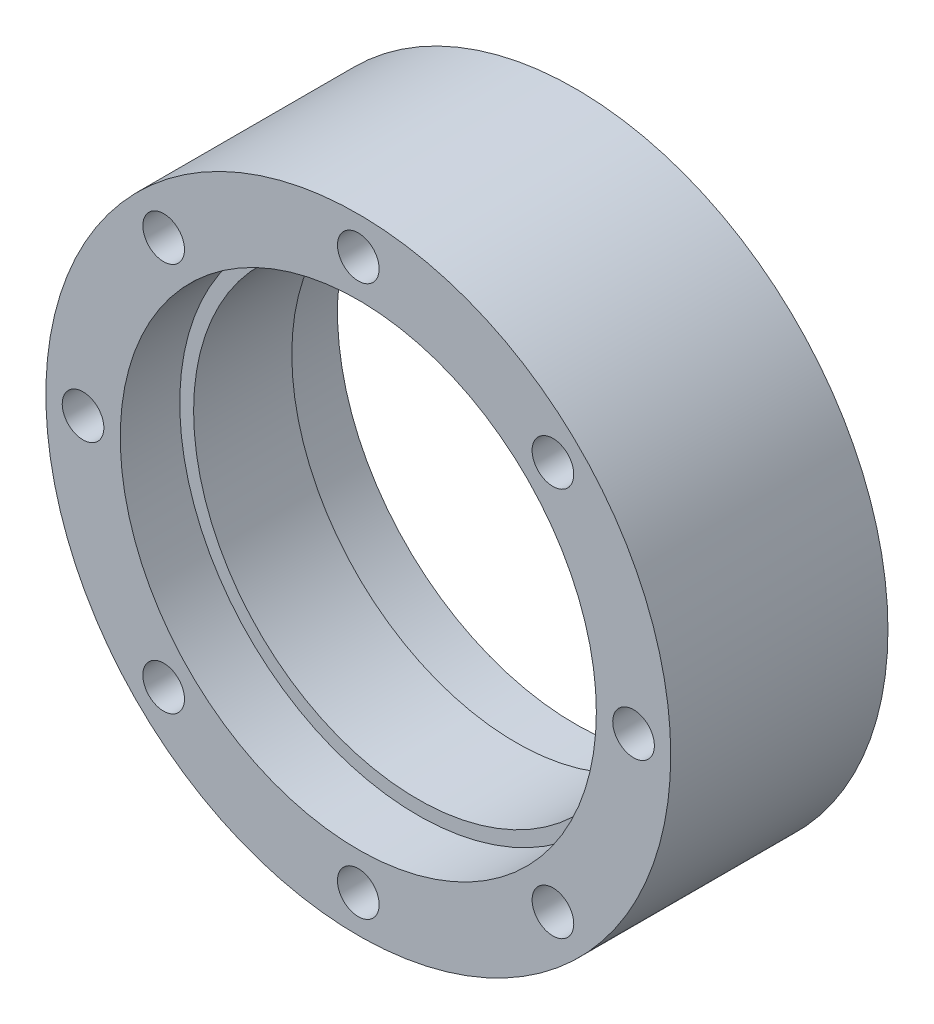
ISO-10303-21;
HEADER;
FILE_DESCRIPTION(('STEP AP214'),'2;1');
FILE_NAME('part.step','',(''),(''),'','','');
FILE_SCHEMA(('AUTOMOTIVE_DESIGN { 1 0 10303 214 1 1 1 1 }'));
ENDSEC;
DATA;
#1=APPLICATION_CONTEXT('core data for automotive mechanical design processes');
#2=APPLICATION_PROTOCOL_DEFINITION('international standard','automotive_design',2000,#1);
#3=PRODUCT_CONTEXT('',#1,'mechanical');
#4=PRODUCT('Part','Part','',(#3));
#5=PRODUCT_RELATED_PRODUCT_CATEGORY('part','',(#4));
#6=PRODUCT_DEFINITION_FORMATION('','',#4);
#7=PRODUCT_DEFINITION_CONTEXT('part definition',#1,'design');
#8=PRODUCT_DEFINITION('design','',#6,#7);
#9=PRODUCT_DEFINITION_SHAPE('','',#8);
#10=(LENGTH_UNIT() NAMED_UNIT(*) SI_UNIT(.MILLI.,.METRE.));
#11=(NAMED_UNIT(*) PLANE_ANGLE_UNIT() SI_UNIT($,.RADIAN.));
#12=(NAMED_UNIT(*) SI_UNIT($,.STERADIAN.) SOLID_ANGLE_UNIT());
#13=UNCERTAINTY_MEASURE_WITH_UNIT(LENGTH_MEASURE(1.E-05),#10,'distance_accuracy_value','');
#14=(GEOMETRIC_REPRESENTATION_CONTEXT(3) GLOBAL_UNCERTAINTY_ASSIGNED_CONTEXT((#13)) GLOBAL_UNIT_ASSIGNED_CONTEXT((#10,
#11,#12)) REPRESENTATION_CONTEXT('',''));
#15=CARTESIAN_POINT('',(0.,0.,0.));
#16=DIRECTION('',(0.,0.,1.));
#17=DIRECTION('',(1.,0.,0.));
#18=AXIS2_PLACEMENT_3D('',#15,#16,#17);
#19=CARTESIAN_POINT('',(0.,18.5,-7.3));
#20=DIRECTION('',(0.,0.,1.));
#21=DIRECTION('',(1.,0.,0.));
#22=AXIS2_PLACEMENT_3D('',#19,#20,#21);
#23=CYLINDRICAL_SURFACE('',#22,1.4);
#24=CARTESIAN_POINT('',(0.,18.5,-4.69999999999999));
#25=DIRECTION('',(0.,0.,-1.));
#26=DIRECTION('',(-1.,0.,0.));
#27=AXIS2_PLACEMENT_3D('',#24,#25,#26);
#28=CIRCLE('',#27,1.4);
#29=CARTESIAN_POINT('',(-1.4,18.5,-4.69999999999999));
#30=VERTEX_POINT('',#29);
#31=EDGE_CURVE('E10',#30,#30,#28,.T.);
#32=ORIENTED_EDGE('',*,*,#31,.T.);
#33=EDGE_LOOP('',(#32));
#34=FACE_BOUND('',#33,.T.);
#35=CARTESIAN_POINT('',(0.,18.5,7.3));
#36=DIRECTION('',(0.,0.,1.));
#37=DIRECTION('',(1.,0.,0.));
#38=AXIS2_PLACEMENT_3D('',#35,#36,#37);
#39=CIRCLE('',#38,1.4);
#40=CARTESIAN_POINT('',(1.4,18.5,7.3));
#41=VERTEX_POINT('',#40);
#42=EDGE_CURVE('E92',#41,#41,#39,.T.);
#43=ORIENTED_EDGE('',*,*,#42,.T.);
#44=EDGE_LOOP('',(#43));
#45=FACE_BOUND('',#44,.T.);
#46=ADVANCED_FACE('F40',(#34,#45),#23,.F.);
#47=CARTESIAN_POINT('',(16.,0.,-7.3));
#48=DIRECTION('',(0.,0.,-1.));
#49=DIRECTION('',(-1.,0.,0.));
#50=AXIS2_PLACEMENT_3D('',#47,#48,#49);
#51=PLANE('',#50);
#52=CARTESIAN_POINT('',(13.0814754519511,-13.0814754519512,-7.3));
#53=DIRECTION('',(0.,0.,1.));
#54=DIRECTION('',(-0.707106781186551,-0.707106781186544,0.));
#55=AXIS2_PLACEMENT_3D('',#52,#53,#54);
#56=CIRCLE('',#55,1.4);
#57=CARTESIAN_POINT('',(12.0915259582899,-14.0714249456124,-7.3));
#58=VERTEX_POINT('',#57);
#59=EDGE_CURVE('E368',#58,#58,#56,.T.);
#60=ORIENTED_EDGE('',*,*,#59,.T.);
#61=EDGE_LOOP('',(#60));
#62=FACE_BOUND('',#61,.T.);
#63=CARTESIAN_POINT('',(-13.0814754519512,-13.081475451951,-7.3));
#64=DIRECTION('',(0.,0.,1.));
#65=DIRECTION('',(-0.707106781186541,0.707106781186554,0.));
#66=AXIS2_PLACEMENT_3D('',#63,#64,#65);
#67=CIRCLE('',#66,1.4);
#68=CARTESIAN_POINT('',(-14.0714249456124,-12.0915259582898,-7.3));
#69=VERTEX_POINT('',#68);
#70=EDGE_CURVE('E378',#69,#69,#67,.T.);
#71=ORIENTED_EDGE('',*,*,#70,.T.);
#72=EDGE_LOOP('',(#71));
#73=FACE_BOUND('',#72,.T.);
#74=CARTESIAN_POINT('',(-13.081475451951,13.0814754519513,-7.3));
#75=DIRECTION('',(0.,0.,1.));
#76=DIRECTION('',(0.707106781186556,0.707106781186539,0.));
#77=AXIS2_PLACEMENT_3D('',#74,#75,#76);
#78=CIRCLE('',#77,1.4);
#79=CARTESIAN_POINT('',(-12.0915259582898,14.0714249456124,-7.3));
#80=VERTEX_POINT('',#79);
#81=EDGE_CURVE('E429',#80,#80,#78,.T.);
#82=ORIENTED_EDGE('',*,*,#81,.T.);
#83=EDGE_LOOP('',(#82));
#84=FACE_BOUND('',#83,.T.);
#85=CARTESIAN_POINT('',(13.0814754519512,13.0814754519511,-7.3));
#86=DIRECTION('',(0.,0.,1.));
#87=DIRECTION('',(0.707106781186546,-0.707106781186549,0.));
#88=AXIS2_PLACEMENT_3D('',#85,#86,#87);
#89=CIRCLE('',#88,1.4);
#90=CARTESIAN_POINT('',(14.0714249456123,12.0915259582899,-7.3));
#91=VERTEX_POINT('',#90);
#92=EDGE_CURVE('E72',#91,#91,#89,.T.);
#93=ORIENTED_EDGE('',*,*,#92,.T.);
#94=EDGE_LOOP('',(#93));
#95=FACE_BOUND('',#94,.T.);
#96=CARTESIAN_POINT('',(18.5,0.,-7.3));
#97=DIRECTION('',(0.,0.,-1.));
#98=DIRECTION('',(-1.,0.,0.));
#99=AXIS2_PLACEMENT_3D('',#96,#97,#98);
#100=CIRCLE('',#99,2.35);
#101=CARTESIAN_POINT('',(16.15,0.,-7.3));
#102=VERTEX_POINT('',#101);
#103=EDGE_CURVE('E65',#102,#102,#100,.F.);
#104=ORIENTED_EDGE('',*,*,#103,.T.);
#105=EDGE_LOOP('',(#104));
#106=FACE_BOUND('',#105,.T.);
#107=CARTESIAN_POINT('',(0.,-18.5,-7.3));
#108=DIRECTION('',(0.,0.,-1.));
#109=DIRECTION('',(-1.,0.,0.));
#110=AXIS2_PLACEMENT_3D('',#107,#108,#109);
#111=CIRCLE('',#110,2.35);
#112=CARTESIAN_POINT('',(-2.35,-18.5,-7.3));
#113=VERTEX_POINT('',#112);
#114=EDGE_CURVE('E61',#113,#113,#111,.F.);
#115=ORIENTED_EDGE('',*,*,#114,.T.);
#116=EDGE_LOOP('',(#115));
#117=FACE_BOUND('',#116,.T.);
#118=CARTESIAN_POINT('',(-18.5,1.93777214305794E-13,-7.3));
#119=DIRECTION('',(0.,0.,-1.));
#120=DIRECTION('',(-1.,0.,0.));
#121=AXIS2_PLACEMENT_3D('',#118,#119,#120);
#122=CIRCLE('',#121,2.35);
#123=CARTESIAN_POINT('',(-20.85,1.93777214305794E-13,-7.3));
#124=VERTEX_POINT('',#123);
#125=EDGE_CURVE('E58',#124,#124,#122,.F.);
#126=ORIENTED_EDGE('',*,*,#125,.T.);
#127=EDGE_LOOP('',(#126));
#128=FACE_BOUND('',#127,.T.);
#129=CARTESIAN_POINT('',(0.,18.5,-7.3));
#130=DIRECTION('',(0.,0.,-1.));
#131=DIRECTION('',(-1.,0.,0.));
#132=AXIS2_PLACEMENT_3D('',#129,#130,#131);
#133=CIRCLE('',#132,2.35);
#134=CARTESIAN_POINT('',(-2.35,18.5,-7.3));
#135=VERTEX_POINT('',#134);
#136=EDGE_CURVE('E91',#135,#135,#133,.F.);
#137=ORIENTED_EDGE('',*,*,#136,.T.);
#138=EDGE_LOOP('',(#137));
#139=FACE_BOUND('',#138,.T.);
#140=CARTESIAN_POINT('',(0.,0.,-7.3));
#141=DIRECTION('',(0.,0.,1.));
#142=DIRECTION('',(1.,0.,0.));
#143=AXIS2_PLACEMENT_3D('',#140,#141,#142);
#144=CIRCLE('',#143,16.);
#145=CARTESIAN_POINT('',(16.,0.,-7.3));
#146=VERTEX_POINT('',#145);
#147=EDGE_CURVE('E95',#146,#146,#144,.T.);
#148=ORIENTED_EDGE('',*,*,#147,.T.);
#149=EDGE_LOOP('',(#148));
#150=FACE_BOUND('',#149,.T.);
#151=CARTESIAN_POINT('',(0.,0.,-7.3));
#152=DIRECTION('',(0.,0.,1.));
#153=DIRECTION('',(1.,0.,0.));
#154=AXIS2_PLACEMENT_3D('',#151,#152,#153);
#155=CIRCLE('',#154,21.);
#156=CARTESIAN_POINT('',(21.,0.,-7.3));
#157=VERTEX_POINT('',#156);
#158=EDGE_CURVE('E54',#157,#157,#155,.T.);
#159=ORIENTED_EDGE('',*,*,#158,.F.);
#160=EDGE_LOOP('',(#159));
#161=FACE_BOUND('',#160,.T.);
#162=ADVANCED_FACE('F120',(#62,#73,#84,#95,#106,#117,#128,#139,#150,#161),#51,.T.);
#163=CARTESIAN_POINT('',(0.,0.,8.03000000000001));
#164=DIRECTION('',(0.,0.,1.));
#165=DIRECTION('',(1.,0.,0.));
#166=AXIS2_PLACEMENT_3D('',#163,#164,#165);
#167=CYLINDRICAL_SURFACE('',#166,21.);
#168=ORIENTED_EDGE('',*,*,#158,.T.);
#169=EDGE_LOOP('',(#168));
#170=FACE_BOUND('',#169,.T.);
#171=CARTESIAN_POINT('',(0.,0.,7.3));
#172=DIRECTION('',(0.,0.,1.));
#173=DIRECTION('',(1.,0.,0.));
#174=AXIS2_PLACEMENT_3D('',#171,#172,#173);
#175=CIRCLE('',#174,21.);
#176=CARTESIAN_POINT('',(21.,0.,7.3));
#177=VERTEX_POINT('',#176);
#178=EDGE_CURVE('E113',#177,#177,#175,.T.);
#179=ORIENTED_EDGE('',*,*,#178,.F.);
#180=EDGE_LOOP('',(#179));
#181=FACE_BOUND('',#180,.T.);
#182=ADVANCED_FACE('F147',(#170,#181),#167,.T.);
#183=CARTESIAN_POINT('',(21.,0.,7.3));
#184=DIRECTION('',(0.,0.,1.));
#185=DIRECTION('',(1.,0.,0.));
#186=AXIS2_PLACEMENT_3D('',#183,#184,#185);
#187=PLANE('',#186);
#188=CARTESIAN_POINT('',(18.5,0.,7.3));
#189=DIRECTION('',(0.,0.,1.));
#190=DIRECTION('',(0.,-1.,0.));
#191=AXIS2_PLACEMENT_3D('',#188,#189,#190);
#192=CIRCLE('',#191,1.4);
#193=CARTESIAN_POINT('',(18.5,-1.40000000000006,7.3));
#194=VERTEX_POINT('',#193);
#195=EDGE_CURVE('E375',#194,#194,#192,.T.);
#196=ORIENTED_EDGE('',*,*,#195,.F.);
#197=EDGE_LOOP('',(#196));
#198=FACE_BOUND('',#197,.T.);
#199=CARTESIAN_POINT('',(13.0814754519511,-13.0814754519512,7.3));
#200=DIRECTION('',(0.,0.,1.));
#201=DIRECTION('',(-0.707106781186551,-0.707106781186544,0.));
#202=AXIS2_PLACEMENT_3D('',#199,#200,#201);
#203=CIRCLE('',#202,1.4);
#204=CARTESIAN_POINT('',(12.0915259582899,-14.0714249456124,7.3));
#205=VERTEX_POINT('',#204);
#206=EDGE_CURVE('E371',#205,#205,#203,.T.);
#207=ORIENTED_EDGE('',*,*,#206,.F.);
#208=EDGE_LOOP('',(#207));
#209=FACE_BOUND('',#208,.T.);
#210=CARTESIAN_POINT('',(0.,-18.5,7.3));
#211=DIRECTION('',(0.,0.,1.));
#212=DIRECTION('',(-1.,0.,0.));
#213=AXIS2_PLACEMENT_3D('',#210,#211,#212);
#214=CIRCLE('',#213,1.4);
#215=CARTESIAN_POINT('',(-1.4,-18.5,7.3));
#216=VERTEX_POINT('',#215);
#217=EDGE_CURVE('E373',#216,#216,#214,.T.);
#218=ORIENTED_EDGE('',*,*,#217,.F.);
#219=EDGE_LOOP('',(#218));
#220=FACE_BOUND('',#219,.T.);
#221=CARTESIAN_POINT('',(-13.0814754519512,-13.081475451951,7.3));
#222=DIRECTION('',(0.,0.,1.));
#223=DIRECTION('',(-0.707106781186541,0.707106781186554,0.));
#224=AXIS2_PLACEMENT_3D('',#221,#222,#223);
#225=CIRCLE('',#224,1.4);
#226=CARTESIAN_POINT('',(-14.0714249456124,-12.0915259582898,7.3));
#227=VERTEX_POINT('',#226);
#228=EDGE_CURVE('E383',#227,#227,#225,.T.);
#229=ORIENTED_EDGE('',*,*,#228,.F.);
#230=EDGE_LOOP('',(#229));
#231=FACE_BOUND('',#230,.T.);
#232=CARTESIAN_POINT('',(-18.5,1.93777214305794E-13,7.3));
#233=DIRECTION('',(0.,0.,1.));
#234=DIRECTION('',(0.,1.,0.));
#235=AXIS2_PLACEMENT_3D('',#232,#233,#234);
#236=CIRCLE('',#235,1.4);
#237=CARTESIAN_POINT('',(-18.5,1.40000000000019,7.3));
#238=VERTEX_POINT('',#237);
#239=EDGE_CURVE('E386',#238,#238,#236,.T.);
#240=ORIENTED_EDGE('',*,*,#239,.F.);
#241=EDGE_LOOP('',(#240));
#242=FACE_BOUND('',#241,.T.);
#243=CARTESIAN_POINT('',(-13.081475451951,13.0814754519513,7.3));
#244=DIRECTION('',(0.,0.,1.));
#245=DIRECTION('',(0.707106781186556,0.707106781186539,0.));
#246=AXIS2_PLACEMENT_3D('',#243,#244,#245);
#247=CIRCLE('',#246,1.4);
#248=CARTESIAN_POINT('',(-12.0915259582898,14.0714249456124,7.3));
#249=VERTEX_POINT('',#248);
#250=EDGE_CURVE('E427',#249,#249,#247,.T.);
#251=ORIENTED_EDGE('',*,*,#250,.F.);
#252=EDGE_LOOP('',(#251));
#253=FACE_BOUND('',#252,.T.);
#254=CARTESIAN_POINT('',(13.0814754519512,13.0814754519511,7.3));
#255=DIRECTION('',(0.,0.,1.));
#256=DIRECTION('',(0.707106781186546,-0.707106781186549,0.));
#257=AXIS2_PLACEMENT_3D('',#254,#255,#256);
#258=CIRCLE('',#257,1.4);
#259=CARTESIAN_POINT('',(14.0714249456123,12.0915259582899,7.3));
#260=VERTEX_POINT('',#259);
#261=EDGE_CURVE('E389',#260,#260,#258,.T.);
#262=ORIENTED_EDGE('',*,*,#261,.F.);
#263=EDGE_LOOP('',(#262));
#264=FACE_BOUND('',#263,.T.);
#265=ORIENTED_EDGE('',*,*,#42,.F.);
#266=EDGE_LOOP('',(#265));
#267=FACE_BOUND('',#266,.T.);
#268=ORIENTED_EDGE('',*,*,#178,.T.);
#269=EDGE_LOOP('',(#268));
#270=FACE_BOUND('',#269,.T.);
#271=CARTESIAN_POINT('',(0.,0.,7.3));
#272=DIRECTION('',(0.,0.,1.));
#273=DIRECTION('',(1.,0.,0.));
#274=AXIS2_PLACEMENT_3D('',#271,#272,#273);
#275=CIRCLE('',#274,16.);
#276=CARTESIAN_POINT('',(16.,0.,7.3));
#277=VERTEX_POINT('',#276);
#278=EDGE_CURVE('E110',#277,#277,#275,.T.);
#279=ORIENTED_EDGE('',*,*,#278,.F.);
#280=EDGE_LOOP('',(#279));
#281=FACE_BOUND('',#280,.T.);
#282=ADVANCED_FACE('F165',(#198,#209,#220,#231,#242,#253,#264,#267,#270,#281),#187,.T.);
#283=CARTESIAN_POINT('',(0.,0.,8.03000000000001));
#284=DIRECTION('',(0.,0.,1.));
#285=DIRECTION('',(1.,0.,0.));
#286=AXIS2_PLACEMENT_3D('',#283,#284,#285);
#287=CYLINDRICAL_SURFACE('',#286,16.);
#288=ORIENTED_EDGE('',*,*,#278,.T.);
#289=EDGE_LOOP('',(#288));
#290=FACE_BOUND('',#289,.T.);
#291=CARTESIAN_POINT('',(0.,0.,3.3));
#292=DIRECTION('',(0.,0.,1.));
#293=DIRECTION('',(1.,0.,0.));
#294=AXIS2_PLACEMENT_3D('',#291,#292,#293);
#295=CIRCLE('',#294,16.);
#296=CARTESIAN_POINT('',(16.,0.,3.3));
#297=VERTEX_POINT('',#296);
#298=EDGE_CURVE('E107',#297,#297,#295,.T.);
#299=ORIENTED_EDGE('',*,*,#298,.F.);
#300=EDGE_LOOP('',(#299));
#301=FACE_BOUND('',#300,.T.);
#302=ADVANCED_FACE('F161',(#290,#301),#287,.F.);
#303=CARTESIAN_POINT('',(16.,0.,3.3));
#304=DIRECTION('',(0.,0.,1.));
#305=DIRECTION('',(1.,0.,0.));
#306=AXIS2_PLACEMENT_3D('',#303,#304,#305);
#307=PLANE('',#306);
#308=ORIENTED_EDGE('',*,*,#298,.T.);
#309=EDGE_LOOP('',(#308));
#310=FACE_BOUND('',#309,.T.);
#311=CARTESIAN_POINT('',(0.,0.,3.3));
#312=DIRECTION('',(0.,0.,1.));
#313=DIRECTION('',(1.,0.,0.));
#314=AXIS2_PLACEMENT_3D('',#311,#312,#313);
#315=CIRCLE('',#314,15.07);
#316=CARTESIAN_POINT('',(15.07,0.,3.3));
#317=VERTEX_POINT('',#316);
#318=EDGE_CURVE('E104',#317,#317,#315,.T.);
#319=ORIENTED_EDGE('',*,*,#318,.F.);
#320=EDGE_LOOP('',(#319));
#321=FACE_BOUND('',#320,.T.);
#322=ADVANCED_FACE('F157',(#310,#321),#307,.T.);
#323=CARTESIAN_POINT('',(0.,0.,8.03000000000001));
#324=DIRECTION('',(0.,0.,1.));
#325=DIRECTION('',(1.,0.,0.));
#326=AXIS2_PLACEMENT_3D('',#323,#324,#325);
#327=CYLINDRICAL_SURFACE('',#326,15.07);
#328=ORIENTED_EDGE('',*,*,#318,.T.);
#329=EDGE_LOOP('',(#328));
#330=FACE_BOUND('',#329,.T.);
#331=CARTESIAN_POINT('',(0.,0.,-3.3));
#332=DIRECTION('',(0.,0.,1.));
#333=DIRECTION('',(1.,0.,0.));
#334=AXIS2_PLACEMENT_3D('',#331,#332,#333);
#335=CIRCLE('',#334,15.07);
#336=CARTESIAN_POINT('',(15.07,0.,-3.3));
#337=VERTEX_POINT('',#336);
#338=EDGE_CURVE('E101',#337,#337,#335,.T.);
#339=ORIENTED_EDGE('',*,*,#338,.F.);
#340=EDGE_LOOP('',(#339));
#341=FACE_BOUND('',#340,.T.);
#342=ADVANCED_FACE('F153',(#330,#341),#327,.F.);
#343=CARTESIAN_POINT('',(16.,0.,-3.3));
#344=DIRECTION('',(0.,0.,-1.));
#345=DIRECTION('',(-1.,0.,0.));
#346=AXIS2_PLACEMENT_3D('',#343,#344,#345);
#347=PLANE('',#346);
#348=ORIENTED_EDGE('',*,*,#338,.T.);
#349=EDGE_LOOP('',(#348));
#350=FACE_BOUND('',#349,.T.);
#351=CARTESIAN_POINT('',(0.,0.,-3.3));
#352=DIRECTION('',(0.,0.,1.));
#353=DIRECTION('',(1.,0.,0.));
#354=AXIS2_PLACEMENT_3D('',#351,#352,#353);
#355=CIRCLE('',#354,16.);
#356=CARTESIAN_POINT('',(16.,0.,-3.3));
#357=VERTEX_POINT('',#356);
#358=EDGE_CURVE('E98',#357,#357,#355,.T.);
#359=ORIENTED_EDGE('',*,*,#358,.F.);
#360=EDGE_LOOP('',(#359));
#361=FACE_BOUND('',#360,.T.);
#362=ADVANCED_FACE('F139',(#350,#361),#347,.T.);
#363=CARTESIAN_POINT('',(0.,0.,8.03000000000001));
#364=DIRECTION('',(0.,0.,1.));
#365=DIRECTION('',(1.,0.,0.));
#366=AXIS2_PLACEMENT_3D('',#363,#364,#365);
#367=CYLINDRICAL_SURFACE('',#366,16.);
#368=ORIENTED_EDGE('',*,*,#358,.T.);
#369=EDGE_LOOP('',(#368));
#370=FACE_BOUND('',#369,.T.);
#371=ORIENTED_EDGE('',*,*,#147,.F.);
#372=EDGE_LOOP('',(#371));
#373=FACE_BOUND('',#372,.T.);
#374=ADVANCED_FACE('F131',(#370,#373),#367,.F.);
#375=CARTESIAN_POINT('',(0.,18.5,-4.8));
#376=DIRECTION('',(0.,0.,-1.));
#377=DIRECTION('',(-1.,0.,0.));
#378=AXIS2_PLACEMENT_3D('',#375,#376,#377);
#379=PLANE('',#378);
#380=CARTESIAN_POINT('',(0.,18.5,-4.8));
#381=DIRECTION('',(0.,0.,-1.));
#382=DIRECTION('',(-1.,0.,0.));
#383=AXIS2_PLACEMENT_3D('',#380,#381,#382);
#384=CIRCLE('',#383,1.50000000000001);
#385=CARTESIAN_POINT('',(-1.50000000000001,18.5,-4.8));
#386=VERTEX_POINT('',#385);
#387=EDGE_CURVE('E49',#386,#386,#384,.F.);
#388=ORIENTED_EDGE('',*,*,#387,.T.);
#389=EDGE_LOOP('',(#388));
#390=FACE_BOUND('',#389,.T.);
#391=CARTESIAN_POINT('',(0.,18.5,-4.8));
#392=DIRECTION('',(0.,0.,-1.));
#393=DIRECTION('',(-1.,0.,0.));
#394=AXIS2_PLACEMENT_3D('',#391,#392,#393);
#395=CIRCLE('',#394,2.35);
#396=CARTESIAN_POINT('',(-2.35,18.5,-4.8));
#397=VERTEX_POINT('',#396);
#398=EDGE_CURVE('E68',#397,#397,#395,.T.);
#399=ORIENTED_EDGE('',*,*,#398,.T.);
#400=EDGE_LOOP('',(#399));
#401=FACE_BOUND('',#400,.T.);
#402=ADVANCED_FACE('F126',(#390,#401),#379,.T.);
#403=CARTESIAN_POINT('',(0.,18.5,-7.300012));
#404=DIRECTION('',(0.,0.,1.));
#405=DIRECTION('',(1.,0.,0.));
#406=AXIS2_PLACEMENT_3D('',#403,#404,#405);
#407=CYLINDRICAL_SURFACE('',#406,2.35);
#408=ORIENTED_EDGE('',*,*,#136,.F.);
#409=EDGE_LOOP('',(#408));
#410=FACE_BOUND('',#409,.T.);
#411=ORIENTED_EDGE('',*,*,#398,.F.);
#412=EDGE_LOOP('',(#411));
#413=FACE_BOUND('',#412,.T.);
#414=ADVANCED_FACE('F123',(#410,#413),#407,.F.);
#415=CARTESIAN_POINT('',(0.,18.5,-4.8));
#416=DIRECTION('',(0.,0.,-1.));
#417=DIRECTION('',(-1.,0.,0.));
#418=AXIS2_PLACEMENT_3D('',#415,#416,#417);
#419=CONICAL_SURFACE('',#418,1.50000000000001,0.785398163397454);
#420=ORIENTED_EDGE('',*,*,#31,.F.);
#421=EDGE_LOOP('',(#420));
#422=FACE_BOUND('',#421,.T.);
#423=ORIENTED_EDGE('',*,*,#387,.F.);
#424=EDGE_LOOP('',(#423));
#425=FACE_BOUND('',#424,.T.);
#426=ADVANCED_FACE('F43',(#422,#425),#419,.F.);
#427=CARTESIAN_POINT('',(-18.5,1.93777214305794E-13,-7.300012));
#428=DIRECTION('',(0.,0.,1.));
#429=DIRECTION('',(1.,0.,0.));
#430=AXIS2_PLACEMENT_3D('',#427,#428,#429);
#431=CYLINDRICAL_SURFACE('',#430,2.35);
#432=ORIENTED_EDGE('',*,*,#125,.F.);
#433=EDGE_LOOP('',(#432));
#434=FACE_BOUND('',#433,.T.);
#435=CARTESIAN_POINT('',(-18.5,1.93777214305794E-13,-4.8));
#436=DIRECTION('',(0.,0.,-1.));
#437=DIRECTION('',(0.,-1.,0.));
#438=AXIS2_PLACEMENT_3D('',#435,#436,#437);
#439=CIRCLE('',#438,2.35);
#440=CARTESIAN_POINT('',(-18.5,-2.34999999999981,-4.8));
#441=VERTEX_POINT('',#440);
#442=EDGE_CURVE('E77',#441,#441,#439,.T.);
#443=ORIENTED_EDGE('',*,*,#442,.F.);
#444=EDGE_LOOP('',(#443));
#445=FACE_BOUND('',#444,.T.);
#446=ADVANCED_FACE('F236',(#434,#445),#431,.F.);
#447=CARTESIAN_POINT('',(-18.5,1.93777214305794E-13,-4.8));
#448=DIRECTION('',(0.,0.,-1.));
#449=DIRECTION('',(0.,-1.,0.));
#450=AXIS2_PLACEMENT_3D('',#447,#448,#449);
#451=PLANE('',#450);
#452=CARTESIAN_POINT('',(-18.5,1.93777214305794E-13,-4.8));
#453=DIRECTION('',(0.,0.,-1.));
#454=DIRECTION('',(-1.,0.,0.));
#455=AXIS2_PLACEMENT_3D('',#452,#453,#454);
#456=CIRCLE('',#455,1.4);
#457=CARTESIAN_POINT('',(-19.9,1.93777214305794E-13,-4.8));
#458=VERTEX_POINT('',#457);
#459=EDGE_CURVE('E45',#458,#458,#456,.T.);
#460=ORIENTED_EDGE('',*,*,#459,.F.);
#461=EDGE_LOOP('',(#460));
#462=FACE_BOUND('',#461,.T.);
#463=ORIENTED_EDGE('',*,*,#442,.T.);
#464=EDGE_LOOP('',(#463));
#465=FACE_BOUND('',#464,.T.);
#466=ADVANCED_FACE('F245',(#462,#465),#451,.T.);
#467=CARTESIAN_POINT('',(0.,-18.5,-7.300012));
#468=DIRECTION('',(0.,0.,1.));
#469=DIRECTION('',(1.,0.,0.));
#470=AXIS2_PLACEMENT_3D('',#467,#468,#469);
#471=CYLINDRICAL_SURFACE('',#470,2.35);
#472=ORIENTED_EDGE('',*,*,#114,.F.);
#473=EDGE_LOOP('',(#472));
#474=FACE_BOUND('',#473,.T.);
#475=CARTESIAN_POINT('',(0.,-18.5,-4.8));
#476=DIRECTION('',(0.,0.,-1.));
#477=DIRECTION('',(1.,0.,0.));
#478=AXIS2_PLACEMENT_3D('',#475,#476,#477);
#479=CIRCLE('',#478,2.35);
#480=CARTESIAN_POINT('',(2.35,-18.5,-4.8));
#481=VERTEX_POINT('',#480);
#482=EDGE_CURVE('E81',#481,#481,#479,.T.);
#483=ORIENTED_EDGE('',*,*,#482,.F.);
#484=EDGE_LOOP('',(#483));
#485=FACE_BOUND('',#484,.T.);
#486=ADVANCED_FACE('F255',(#474,#485),#471,.F.);
#487=CARTESIAN_POINT('',(0.,-18.5,-4.8));
#488=DIRECTION('',(0.,0.,-1.));
#489=DIRECTION('',(1.,0.,0.));
#490=AXIS2_PLACEMENT_3D('',#487,#488,#489);
#491=PLANE('',#490);
#492=CARTESIAN_POINT('',(0.,-18.5,-4.8));
#493=DIRECTION('',(0.,0.,-1.));
#494=DIRECTION('',(-1.,0.,0.));
#495=AXIS2_PLACEMENT_3D('',#492,#493,#494);
#496=CIRCLE('',#495,1.4);
#497=CARTESIAN_POINT('',(-1.4,-18.5,-4.8));
#498=VERTEX_POINT('',#497);
#499=EDGE_CURVE('E71',#498,#498,#496,.T.);
#500=ORIENTED_EDGE('',*,*,#499,.F.);
#501=EDGE_LOOP('',(#500));
#502=FACE_BOUND('',#501,.T.);
#503=ORIENTED_EDGE('',*,*,#482,.T.);
#504=EDGE_LOOP('',(#503));
#505=FACE_BOUND('',#504,.T.);
#506=ADVANCED_FACE('F265',(#502,#505),#491,.T.);
#507=CARTESIAN_POINT('',(18.5,0.,-7.300012));
#508=DIRECTION('',(0.,0.,1.));
#509=DIRECTION('',(1.,0.,0.));
#510=AXIS2_PLACEMENT_3D('',#507,#508,#509);
#511=CYLINDRICAL_SURFACE('',#510,2.35);
#512=ORIENTED_EDGE('',*,*,#103,.F.);
#513=EDGE_LOOP('',(#512));
#514=FACE_BOUND('',#513,.T.);
#515=CARTESIAN_POINT('',(18.5,0.,-4.8));
#516=DIRECTION('',(0.,0.,-1.));
#517=DIRECTION('',(0.,1.,0.));
#518=AXIS2_PLACEMENT_3D('',#515,#516,#517);
#519=CIRCLE('',#518,2.35);
#520=CARTESIAN_POINT('',(18.5,2.34999999999994,-4.8));
#521=VERTEX_POINT('',#520);
#522=EDGE_CURVE('E62',#521,#521,#519,.T.);
#523=ORIENTED_EDGE('',*,*,#522,.F.);
#524=EDGE_LOOP('',(#523));
#525=FACE_BOUND('',#524,.T.);
#526=ADVANCED_FACE('F275',(#514,#525),#511,.F.);
#527=CARTESIAN_POINT('',(18.5,0.,-4.8));
#528=DIRECTION('',(0.,0.,-1.));
#529=DIRECTION('',(0.,1.,0.));
#530=AXIS2_PLACEMENT_3D('',#527,#528,#529);
#531=PLANE('',#530);
#532=CARTESIAN_POINT('',(18.5,0.,-4.8));
#533=DIRECTION('',(0.,0.,-1.));
#534=DIRECTION('',(-1.,0.,0.));
#535=AXIS2_PLACEMENT_3D('',#532,#533,#534);
#536=CIRCLE('',#535,1.4);
#537=CARTESIAN_POINT('',(17.1,0.,-4.8));
#538=VERTEX_POINT('',#537);
#539=EDGE_CURVE('E69',#538,#538,#536,.T.);
#540=ORIENTED_EDGE('',*,*,#539,.F.);
#541=EDGE_LOOP('',(#540));
#542=FACE_BOUND('',#541,.T.);
#543=ORIENTED_EDGE('',*,*,#522,.T.);
#544=EDGE_LOOP('',(#543));
#545=FACE_BOUND('',#544,.T.);
#546=ADVANCED_FACE('F285',(#542,#545),#531,.T.);
#547=CARTESIAN_POINT('',(18.5,0.,-7.3));
#548=DIRECTION('',(0.,0.,1.));
#549=DIRECTION('',(1.,0.,0.));
#550=AXIS2_PLACEMENT_3D('',#547,#548,#549);
#551=CYLINDRICAL_SURFACE('',#550,1.4);
#552=ORIENTED_EDGE('',*,*,#539,.T.);
#553=EDGE_LOOP('',(#552));
#554=FACE_BOUND('',#553,.T.);
#555=ORIENTED_EDGE('',*,*,#195,.T.);
#556=EDGE_LOOP('',(#555));
#557=FACE_BOUND('',#556,.T.);
#558=ADVANCED_FACE('F294',(#554,#557),#551,.F.);
#559=CARTESIAN_POINT('',(0.,-18.5,-7.3));
#560=DIRECTION('',(0.,0.,1.));
#561=DIRECTION('',(1.,0.,0.));
#562=AXIS2_PLACEMENT_3D('',#559,#560,#561);
#563=CYLINDRICAL_SURFACE('',#562,1.4);
#564=ORIENTED_EDGE('',*,*,#499,.T.);
#565=EDGE_LOOP('',(#564));
#566=FACE_BOUND('',#565,.T.);
#567=ORIENTED_EDGE('',*,*,#217,.T.);
#568=EDGE_LOOP('',(#567));
#569=FACE_BOUND('',#568,.T.);
#570=ADVANCED_FACE('F304',(#566,#569),#563,.F.);
#571=CARTESIAN_POINT('',(-18.5,1.93777214305794E-13,-7.3));
#572=DIRECTION('',(0.,0.,1.));
#573=DIRECTION('',(1.,0.,0.));
#574=AXIS2_PLACEMENT_3D('',#571,#572,#573);
#575=CYLINDRICAL_SURFACE('',#574,1.4);
#576=ORIENTED_EDGE('',*,*,#459,.T.);
#577=EDGE_LOOP('',(#576));
#578=FACE_BOUND('',#577,.T.);
#579=ORIENTED_EDGE('',*,*,#239,.T.);
#580=EDGE_LOOP('',(#579));
#581=FACE_BOUND('',#580,.T.);
#582=ADVANCED_FACE('F314',(#578,#581),#575,.F.);
#583=CARTESIAN_POINT('',(13.0814754519512,13.0814754519511,-7.3));
#584=DIRECTION('',(0.,0.,1.));
#585=DIRECTION('',(1.,0.,0.));
#586=AXIS2_PLACEMENT_3D('',#583,#584,#585);
#587=CYLINDRICAL_SURFACE('',#586,1.4);
#588=ORIENTED_EDGE('',*,*,#92,.F.);
#589=EDGE_LOOP('',(#588));
#590=FACE_BOUND('',#589,.T.);
#591=ORIENTED_EDGE('',*,*,#261,.T.);
#592=EDGE_LOOP('',(#591));
#593=FACE_BOUND('',#592,.T.);
#594=ADVANCED_FACE('F323',(#590,#593),#587,.F.);
#595=CARTESIAN_POINT('',(-13.081475451951,13.0814754519513,-7.3));
#596=DIRECTION('',(0.,0.,1.));
#597=DIRECTION('',(1.,0.,0.));
#598=AXIS2_PLACEMENT_3D('',#595,#596,#597);
#599=CYLINDRICAL_SURFACE('',#598,1.4);
#600=ORIENTED_EDGE('',*,*,#81,.F.);
#601=EDGE_LOOP('',(#600));
#602=FACE_BOUND('',#601,.T.);
#603=ORIENTED_EDGE('',*,*,#250,.T.);
#604=EDGE_LOOP('',(#603));
#605=FACE_BOUND('',#604,.T.);
#606=ADVANCED_FACE('F332',(#602,#605),#599,.F.);
#607=CARTESIAN_POINT('',(-13.0814754519512,-13.081475451951,-7.3));
#608=DIRECTION('',(0.,0.,1.));
#609=DIRECTION('',(1.,0.,0.));
#610=AXIS2_PLACEMENT_3D('',#607,#608,#609);
#611=CYLINDRICAL_SURFACE('',#610,1.4);
#612=ORIENTED_EDGE('',*,*,#70,.F.);
#613=EDGE_LOOP('',(#612));
#614=FACE_BOUND('',#613,.T.);
#615=ORIENTED_EDGE('',*,*,#228,.T.);
#616=EDGE_LOOP('',(#615));
#617=FACE_BOUND('',#616,.T.);
#618=ADVANCED_FACE('F342',(#614,#617),#611,.F.);
#619=CARTESIAN_POINT('',(13.0814754519511,-13.0814754519512,-7.3));
#620=DIRECTION('',(0.,0.,1.));
#621=DIRECTION('',(1.,0.,0.));
#622=AXIS2_PLACEMENT_3D('',#619,#620,#621);
#623=CYLINDRICAL_SURFACE('',#622,1.4);
#624=ORIENTED_EDGE('',*,*,#59,.F.);
#625=EDGE_LOOP('',(#624));
#626=FACE_BOUND('',#625,.T.);
#627=ORIENTED_EDGE('',*,*,#206,.T.);
#628=EDGE_LOOP('',(#627));
#629=FACE_BOUND('',#628,.T.);
#630=ADVANCED_FACE('F352',(#626,#629),#623,.F.);
#631=CLOSED_SHELL('',(#46,#162,#182,#282,#302,#322,#342,#362,#374,#402,#414,#426,#446,#466,#486,
#506,#526,#546,#558,#570,#582,#594,#606,#618,#630));
#632=MANIFOLD_SOLID_BREP('B2',#631);
#633=ADVANCED_BREP_SHAPE_REPRESENTATION('',(#18,#632),#14);
#634=SHAPE_DEFINITION_REPRESENTATION(#9,#633);
ENDSEC;
END-ISO-10303-21;
